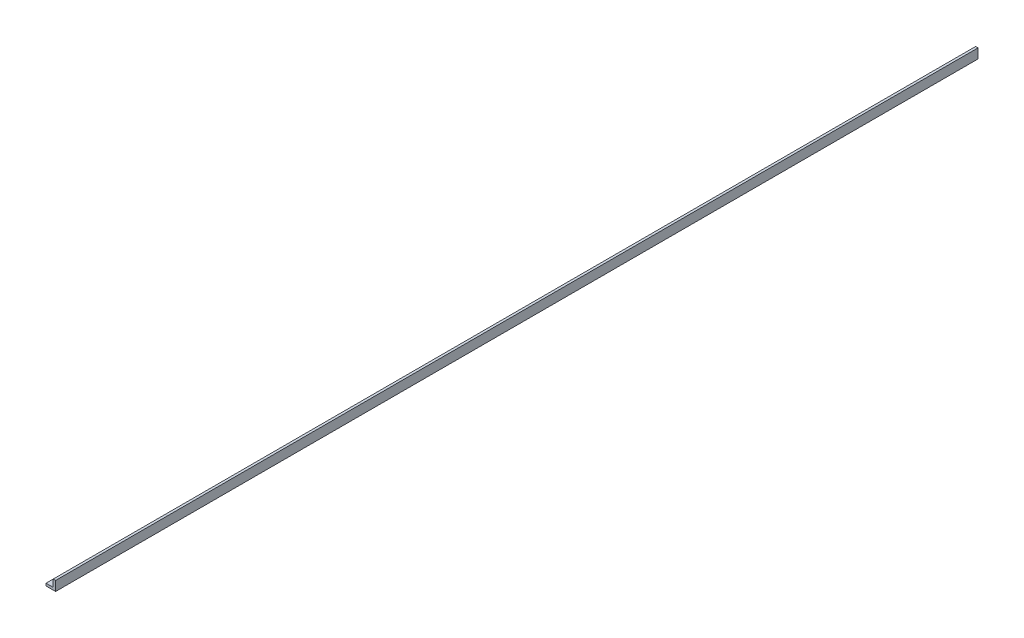
ISO-10303-21;
HEADER;
FILE_DESCRIPTION(('STEP AP214'),'2;1');
FILE_NAME('part.step','',(''),(''),'','','');
FILE_SCHEMA(('AUTOMOTIVE_DESIGN { 1 0 10303 214 1 1 1 1 }'));
ENDSEC;
DATA;
#1=APPLICATION_CONTEXT('core data for automotive mechanical design processes');
#2=APPLICATION_PROTOCOL_DEFINITION('international standard','automotive_design',2000,#1);
#3=PRODUCT_CONTEXT('',#1,'mechanical');
#4=PRODUCT('Part','Part','',(#3));
#5=PRODUCT_RELATED_PRODUCT_CATEGORY('part','',(#4));
#6=PRODUCT_DEFINITION_FORMATION('','',#4);
#7=PRODUCT_DEFINITION_CONTEXT('part definition',#1,'design');
#8=PRODUCT_DEFINITION('design','',#6,#7);
#9=PRODUCT_DEFINITION_SHAPE('','',#8);
#10=(LENGTH_UNIT() NAMED_UNIT(*) SI_UNIT(.MILLI.,.METRE.));
#11=(NAMED_UNIT(*) PLANE_ANGLE_UNIT() SI_UNIT($,.RADIAN.));
#12=(NAMED_UNIT(*) SI_UNIT($,.STERADIAN.) SOLID_ANGLE_UNIT());
#13=UNCERTAINTY_MEASURE_WITH_UNIT(LENGTH_MEASURE(1.E-05),#10,'distance_accuracy_value','');
#14=(GEOMETRIC_REPRESENTATION_CONTEXT(3) GLOBAL_UNCERTAINTY_ASSIGNED_CONTEXT((#13)) GLOBAL_UNIT_ASSIGNED_CONTEXT((#10,
#11,#12)) REPRESENTATION_CONTEXT('',''));
#15=CARTESIAN_POINT('',(0.,0.,0.));
#16=DIRECTION('',(0.,0.,1.));
#17=DIRECTION('',(1.,0.,0.));
#18=AXIS2_PLACEMENT_3D('',#15,#16,#17);
#19=CARTESIAN_POINT('',(-6.35,0.,609.6));
#20=DIRECTION('',(1.,0.,0.));
#21=DIRECTION('',(0.,0.,-1.));
#22=AXIS2_PLACEMENT_3D('',#19,#20,#21);
#23=PLANE('',#22);
#24=DIRECTION('',(0.,-1.,0.));
#25=VECTOR('',#24,1.);
#26=CARTESIAN_POINT('',(-6.35,0.,-609.6));
#27=LINE('',#26,#25);
#28=CARTESIAN_POINT('',(-6.35,3.175,-609.6));
#29=VERTEX_POINT('',#28);
#30=CARTESIAN_POINT('',(-6.35,0.,-609.6));
#31=VERTEX_POINT('',#30);
#32=EDGE_CURVE('E116',#29,#31,#27,.T.);
#33=ORIENTED_EDGE('',*,*,#32,.T.);
#34=DIRECTION('',(0.,0.,-1.));
#35=VECTOR('',#34,1.);
#36=CARTESIAN_POINT('',(-6.35,0.,609.6));
#37=LINE('',#36,#35);
#38=CARTESIAN_POINT('',(-6.35,0.,609.6));
#39=VERTEX_POINT('',#38);
#40=EDGE_CURVE('E11',#39,#31,#37,.T.);
#41=ORIENTED_EDGE('',*,*,#40,.F.);
#42=DIRECTION('',(0.,-1.,0.));
#43=VECTOR('',#42,1.);
#44=CARTESIAN_POINT('',(-6.35,0.,609.6));
#45=LINE('',#44,#43);
#46=CARTESIAN_POINT('',(-6.35,3.175,609.6));
#47=VERTEX_POINT('',#46);
#48=EDGE_CURVE('E126',#47,#39,#45,.T.);
#49=ORIENTED_EDGE('',*,*,#48,.F.);
#50=DIRECTION('',(0.,0.,-1.));
#51=VECTOR('',#50,1.);
#52=CARTESIAN_POINT('',(-6.35,3.175,609.6));
#53=LINE('',#52,#51);
#54=EDGE_CURVE('E112',#47,#29,#53,.T.);
#55=ORIENTED_EDGE('',*,*,#54,.T.);
#56=EDGE_LOOP('',(#33,#41,#49,#55));
#57=FACE_BOUND('',#56,.T.);
#58=ADVANCED_FACE('F32',(#57),#23,.F.);
#59=CARTESIAN_POINT('',(-6.35,0.,609.6));
#60=DIRECTION('',(0.,1.,0.));
#61=DIRECTION('',(0.,0.,1.));
#62=AXIS2_PLACEMENT_3D('',#59,#60,#61);
#63=PLANE('',#62);
#64=DIRECTION('',(1.,0.,0.));
#65=VECTOR('',#64,1.);
#66=CARTESIAN_POINT('',(-6.35,0.,-609.6));
#67=LINE('',#66,#65);
#68=CARTESIAN_POINT('',(6.35,0.,-609.6));
#69=VERTEX_POINT('',#68);
#70=EDGE_CURVE('E119',#31,#69,#67,.T.);
#71=ORIENTED_EDGE('',*,*,#70,.T.);
#72=DIRECTION('',(0.,0.,-1.));
#73=VECTOR('',#72,1.);
#74=CARTESIAN_POINT('',(6.35,0.,609.6));
#75=LINE('',#74,#73);
#76=CARTESIAN_POINT('',(6.35,0.,609.6));
#77=VERTEX_POINT('',#76);
#78=EDGE_CURVE('E40',#77,#69,#75,.T.);
#79=ORIENTED_EDGE('',*,*,#78,.F.);
#80=DIRECTION('',(1.,0.,0.));
#81=VECTOR('',#80,1.);
#82=CARTESIAN_POINT('',(-6.35,0.,609.6));
#83=LINE('',#82,#81);
#84=EDGE_CURVE('E85',#39,#77,#83,.T.);
#85=ORIENTED_EDGE('',*,*,#84,.F.);
#86=ORIENTED_EDGE('',*,*,#40,.T.);
#87=EDGE_LOOP('',(#71,#79,#85,#86));
#88=FACE_BOUND('',#87,.T.);
#89=ADVANCED_FACE('F150',(#88),#63,.F.);
#90=CARTESIAN_POINT('',(6.35,0.,609.6));
#91=DIRECTION('',(-1.,0.,0.));
#92=DIRECTION('',(0.,0.,1.));
#93=AXIS2_PLACEMENT_3D('',#90,#91,#92);
#94=PLANE('',#93);
#95=DIRECTION('',(0.,1.,0.));
#96=VECTOR('',#95,1.);
#97=CARTESIAN_POINT('',(6.35,0.,-609.6));
#98=LINE('',#97,#96);
#99=CARTESIAN_POINT('',(6.35,12.7,-609.6));
#100=VERTEX_POINT('',#99);
#101=EDGE_CURVE('E121',#69,#100,#98,.T.);
#102=ORIENTED_EDGE('',*,*,#101,.T.);
#103=DIRECTION('',(0.,0.,-1.));
#104=VECTOR('',#103,1.);
#105=CARTESIAN_POINT('',(6.35,12.7,609.6));
#106=LINE('',#105,#104);
#107=CARTESIAN_POINT('',(6.35,12.7,609.6));
#108=VERTEX_POINT('',#107);
#109=EDGE_CURVE('E107',#108,#100,#106,.T.);
#110=ORIENTED_EDGE('',*,*,#109,.F.);
#111=DIRECTION('',(0.,1.,0.));
#112=VECTOR('',#111,1.);
#113=CARTESIAN_POINT('',(6.35,0.,609.6));
#114=LINE('',#113,#112);
#115=EDGE_CURVE('E98',#77,#108,#114,.T.);
#116=ORIENTED_EDGE('',*,*,#115,.F.);
#117=ORIENTED_EDGE('',*,*,#78,.T.);
#118=EDGE_LOOP('',(#102,#110,#116,#117));
#119=FACE_BOUND('',#118,.T.);
#120=ADVANCED_FACE('F132',(#119),#94,.F.);
#121=CARTESIAN_POINT('',(6.35,12.7,609.6));
#122=DIRECTION('',(0.,-1.,0.));
#123=DIRECTION('',(0.,0.,-1.));
#124=AXIS2_PLACEMENT_3D('',#121,#122,#123);
#125=PLANE('',#124);
#126=DIRECTION('',(-1.,0.,0.));
#127=VECTOR('',#126,1.);
#128=CARTESIAN_POINT('',(6.35,12.7,-609.6));
#129=LINE('',#128,#127);
#130=CARTESIAN_POINT('',(3.175,12.7,-609.6));
#131=VERTEX_POINT('',#130);
#132=EDGE_CURVE('E106',#100,#131,#129,.T.);
#133=ORIENTED_EDGE('',*,*,#132,.T.);
#134=DIRECTION('',(0.,0.,-1.));
#135=VECTOR('',#134,1.);
#136=CARTESIAN_POINT('',(3.175,12.7,609.6));
#137=LINE('',#136,#135);
#138=CARTESIAN_POINT('',(3.175,12.7,609.6));
#139=VERTEX_POINT('',#138);
#140=EDGE_CURVE('E103',#139,#131,#137,.T.);
#141=ORIENTED_EDGE('',*,*,#140,.F.);
#142=DIRECTION('',(-1.,0.,0.));
#143=VECTOR('',#142,1.);
#144=CARTESIAN_POINT('',(6.35,12.7,609.6));
#145=LINE('',#144,#143);
#146=EDGE_CURVE('E92',#108,#139,#145,.T.);
#147=ORIENTED_EDGE('',*,*,#146,.F.);
#148=ORIENTED_EDGE('',*,*,#109,.T.);
#149=EDGE_LOOP('',(#133,#141,#147,#148));
#150=FACE_BOUND('',#149,.T.);
#151=ADVANCED_FACE('F104',(#150),#125,.F.);
#152=CARTESIAN_POINT('',(3.175,12.7,609.6));
#153=DIRECTION('',(1.,0.,0.));
#154=DIRECTION('',(0.,1.,0.));
#155=AXIS2_PLACEMENT_3D('',#152,#153,#154);
#156=PLANE('',#155);
#157=DIRECTION('',(0.,-1.,0.));
#158=VECTOR('',#157,1.);
#159=CARTESIAN_POINT('',(3.175,12.7,-609.6));
#160=LINE('',#159,#158);
#161=CARTESIAN_POINT('',(3.175,3.175,-609.6));
#162=VERTEX_POINT('',#161);
#163=EDGE_CURVE('E71',#131,#162,#160,.T.);
#164=ORIENTED_EDGE('',*,*,#163,.T.);
#165=DIRECTION('',(0.,0.,-1.));
#166=VECTOR('',#165,1.);
#167=CARTESIAN_POINT('',(3.175,3.175,609.6));
#168=LINE('',#167,#166);
#169=CARTESIAN_POINT('',(3.175,3.175,609.6));
#170=VERTEX_POINT('',#169);
#171=EDGE_CURVE('E108',#170,#162,#168,.T.);
#172=ORIENTED_EDGE('',*,*,#171,.F.);
#173=DIRECTION('',(0.,-1.,0.));
#174=VECTOR('',#173,1.);
#175=CARTESIAN_POINT('',(3.175,12.7,609.6));
#176=LINE('',#175,#174);
#177=EDGE_CURVE('E96',#139,#170,#176,.T.);
#178=ORIENTED_EDGE('',*,*,#177,.F.);
#179=ORIENTED_EDGE('',*,*,#140,.T.);
#180=EDGE_LOOP('',(#164,#172,#178,#179));
#181=FACE_BOUND('',#180,.T.);
#182=ADVANCED_FACE('F110',(#181),#156,.F.);
#183=CARTESIAN_POINT('',(3.175,3.175,609.6));
#184=DIRECTION('',(0.,-1.,0.));
#185=DIRECTION('',(1.,0.,0.));
#186=AXIS2_PLACEMENT_3D('',#183,#184,#185);
#187=PLANE('',#186);
#188=DIRECTION('',(-1.,0.,0.));
#189=VECTOR('',#188,1.);
#190=CARTESIAN_POINT('',(3.175,3.175,-609.6));
#191=LINE('',#190,#189);
#192=EDGE_CURVE('E77',#162,#29,#191,.T.);
#193=ORIENTED_EDGE('',*,*,#192,.T.);
#194=ORIENTED_EDGE('',*,*,#54,.F.);
#195=DIRECTION('',(-1.,0.,0.));
#196=VECTOR('',#195,1.);
#197=CARTESIAN_POINT('',(3.175,3.175,609.6));
#198=LINE('',#197,#196);
#199=EDGE_CURVE('E48',#170,#47,#198,.T.);
#200=ORIENTED_EDGE('',*,*,#199,.F.);
#201=ORIENTED_EDGE('',*,*,#171,.T.);
#202=EDGE_LOOP('',(#193,#194,#200,#201));
#203=FACE_BOUND('',#202,.T.);
#204=ADVANCED_FACE('F139',(#203),#187,.F.);
#205=CARTESIAN_POINT('',(-6.35,3.175,609.6));
#206=DIRECTION('',(0.,0.,1.));
#207=DIRECTION('',(1.,0.,0.));
#208=AXIS2_PLACEMENT_3D('',#205,#206,#207);
#209=PLANE('',#208);
#210=ORIENTED_EDGE('',*,*,#48,.T.);
#211=ORIENTED_EDGE('',*,*,#84,.T.);
#212=ORIENTED_EDGE('',*,*,#115,.T.);
#213=ORIENTED_EDGE('',*,*,#146,.T.);
#214=ORIENTED_EDGE('',*,*,#177,.T.);
#215=ORIENTED_EDGE('',*,*,#199,.T.);
#216=EDGE_LOOP('',(#210,#211,#212,#213,#214,#215));
#217=FACE_BOUND('',#216,.T.);
#218=ADVANCED_FACE('F94',(#217),#209,.T.);
#219=CARTESIAN_POINT('',(-6.35,3.175,-609.6));
#220=DIRECTION('',(0.,0.,1.));
#221=DIRECTION('',(1.,0.,0.));
#222=AXIS2_PLACEMENT_3D('',#219,#220,#221);
#223=PLANE('',#222);
#224=ORIENTED_EDGE('',*,*,#32,.F.);
#225=ORIENTED_EDGE('',*,*,#192,.F.);
#226=ORIENTED_EDGE('',*,*,#163,.F.);
#227=ORIENTED_EDGE('',*,*,#132,.F.);
#228=ORIENTED_EDGE('',*,*,#101,.F.);
#229=ORIENTED_EDGE('',*,*,#70,.F.);
#230=EDGE_LOOP('',(#224,#225,#226,#227,#228,#229));
#231=FACE_BOUND('',#230,.T.);
#232=ADVANCED_FACE('F135',(#231),#223,.F.);
#233=CLOSED_SHELL('',(#58,#89,#120,#151,#182,#204,#218,#232));
#234=MANIFOLD_SOLID_BREP('B2',#233);
#235=ADVANCED_BREP_SHAPE_REPRESENTATION('',(#18,#234),#14);
#236=SHAPE_DEFINITION_REPRESENTATION(#9,#235);
ENDSEC;
END-ISO-10303-21;
